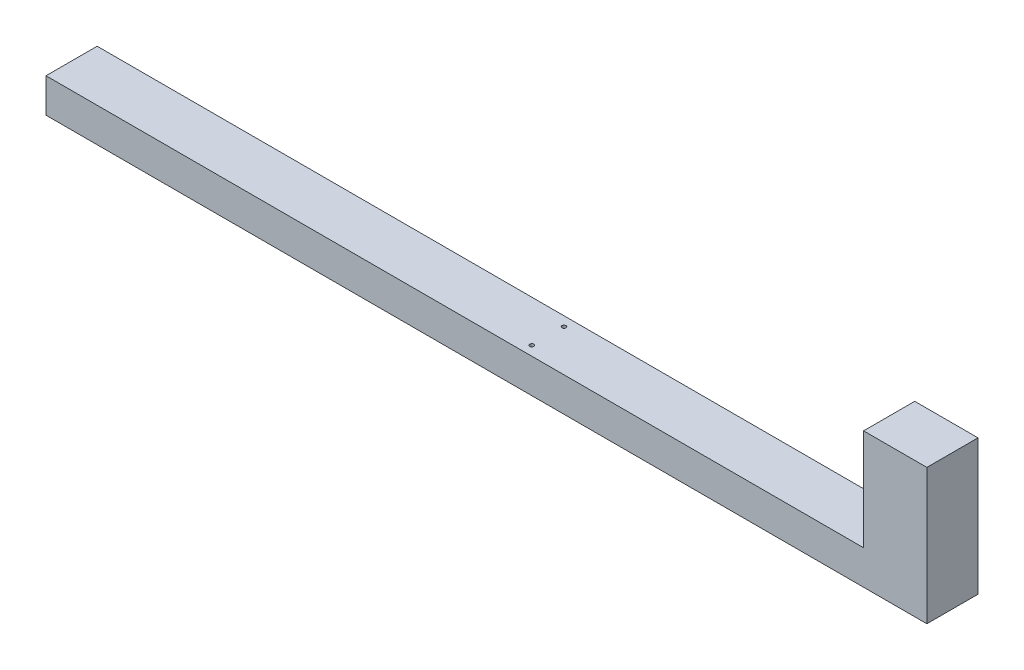
ISO-10303-21;
HEADER;
FILE_DESCRIPTION(('STEP AP214'),'2;1');
FILE_NAME('part.step','',(''),(''),'','','');
FILE_SCHEMA(('AUTOMOTIVE_DESIGN { 1 0 10303 214 1 1 1 1 }'));
ENDSEC;
DATA;
#1=APPLICATION_CONTEXT('core data for automotive mechanical design processes');
#2=APPLICATION_PROTOCOL_DEFINITION('international standard','automotive_design',2000,#1);
#3=PRODUCT_CONTEXT('',#1,'mechanical');
#4=PRODUCT('Part','Part','',(#3));
#5=PRODUCT_RELATED_PRODUCT_CATEGORY('part','',(#4));
#6=PRODUCT_DEFINITION_FORMATION('','',#4);
#7=PRODUCT_DEFINITION_CONTEXT('part definition',#1,'design');
#8=PRODUCT_DEFINITION('design','',#6,#7);
#9=PRODUCT_DEFINITION_SHAPE('','',#8);
#10=(LENGTH_UNIT() NAMED_UNIT(*) SI_UNIT(.MILLI.,.METRE.));
#11=(NAMED_UNIT(*) PLANE_ANGLE_UNIT() SI_UNIT($,.RADIAN.));
#12=(NAMED_UNIT(*) SI_UNIT($,.STERADIAN.) SOLID_ANGLE_UNIT());
#13=UNCERTAINTY_MEASURE_WITH_UNIT(LENGTH_MEASURE(1.E-05),#10,'distance_accuracy_value','');
#14=(GEOMETRIC_REPRESENTATION_CONTEXT(3) GLOBAL_UNCERTAINTY_ASSIGNED_CONTEXT((#13)) GLOBAL_UNIT_ASSIGNED_CONTEXT((#10,
#11,#12)) REPRESENTATION_CONTEXT('',''));
#15=CARTESIAN_POINT('',(0.,0.,0.));
#16=DIRECTION('',(0.,0.,1.));
#17=DIRECTION('',(1.,0.,0.));
#18=AXIS2_PLACEMENT_3D('',#15,#16,#17);
#19=CARTESIAN_POINT('',(-559.5,46.8,35.0000000000001));
#20=DIRECTION('',(1.,0.,0.));
#21=DIRECTION('',(0.,0.,-1.));
#22=AXIS2_PLACEMENT_3D('',#19,#20,#21);
#23=PLANE('',#22);
#24=DIRECTION('',(0.,0.,1.));
#25=VECTOR('',#24,1.);
#26=CARTESIAN_POINT('',(-559.5,0.,35.0000000000001));
#27=LINE('',#26,#25);
#28=CARTESIAN_POINT('',(-559.5,0.,-34.9999999999999));
#29=VERTEX_POINT('',#28);
#30=CARTESIAN_POINT('',(-559.5,0.,35.0000000000001));
#31=VERTEX_POINT('',#30);
#32=EDGE_CURVE('E100',#29,#31,#27,.T.);
#33=ORIENTED_EDGE('',*,*,#32,.T.);
#34=DIRECTION('',(0.,-1.,0.));
#35=VECTOR('',#34,1.);
#36=CARTESIAN_POINT('',(-559.5,46.8,35.0000000000001));
#37=LINE('',#36,#35);
#38=CARTESIAN_POINT('',(-559.5,46.8,35.0000000000001));
#39=VERTEX_POINT('',#38);
#40=EDGE_CURVE('E11',#39,#31,#37,.T.);
#41=ORIENTED_EDGE('',*,*,#40,.F.);
#42=DIRECTION('',(0.,0.,1.));
#43=VECTOR('',#42,1.);
#44=CARTESIAN_POINT('',(-559.5,46.8,35.0000000000001));
#45=LINE('',#44,#43);
#46=CARTESIAN_POINT('',(-559.5,46.8,-34.9999999999999));
#47=VERTEX_POINT('',#46);
#48=EDGE_CURVE('E92',#47,#39,#45,.T.);
#49=ORIENTED_EDGE('',*,*,#48,.F.);
#50=DIRECTION('',(0.,-1.,0.));
#51=VECTOR('',#50,1.);
#52=CARTESIAN_POINT('',(-559.5,46.8,-34.9999999999999));
#53=LINE('',#52,#51);
#54=EDGE_CURVE('E48',#47,#29,#53,.T.);
#55=ORIENTED_EDGE('',*,*,#54,.T.);
#56=EDGE_LOOP('',(#33,#41,#49,#55));
#57=FACE_BOUND('',#56,.T.);
#58=ADVANCED_FACE('F40',(#57),#23,.F.);
#59=CARTESIAN_POINT('',(559.5,46.8,34.9999999999999));
#60=DIRECTION('',(0.,0.,-1.));
#61=DIRECTION('',(-1.,0.,0.));
#62=AXIS2_PLACEMENT_3D('',#59,#60,#61);
#63=PLANE('',#62);
#64=DIRECTION('',(1.,0.,0.));
#65=VECTOR('',#64,1.);
#66=CARTESIAN_POINT('',(559.5,0.,34.9999999999999));
#67=LINE('',#66,#65);
#68=CARTESIAN_POINT('',(646.1,0.,34.9999999999999));
#69=VERTEX_POINT('',#68);
#70=EDGE_CURVE('E69',#31,#69,#67,.T.);
#71=ORIENTED_EDGE('',*,*,#70,.T.);
#72=DIRECTION('',(0.,-1.,0.));
#73=VECTOR('',#72,1.);
#74=CARTESIAN_POINT('',(646.1,185.4,34.9999999999999));
#75=LINE('',#74,#73);
#76=CARTESIAN_POINT('',(646.1,185.4,34.9999999999999));
#77=VERTEX_POINT('',#76);
#78=EDGE_CURVE('E104',#77,#69,#75,.T.);
#79=ORIENTED_EDGE('',*,*,#78,.F.);
#80=DIRECTION('',(-1.,0.,0.));
#81=VECTOR('',#80,1.);
#82=CARTESIAN_POINT('',(559.5,185.4,34.9999999999999));
#83=LINE('',#82,#81);
#84=CARTESIAN_POINT('',(559.5,185.4,34.9999999999999));
#85=VERTEX_POINT('',#84);
#86=EDGE_CURVE('E113',#77,#85,#83,.T.);
#87=ORIENTED_EDGE('',*,*,#86,.T.);
#88=DIRECTION('',(0.,-1.,0.));
#89=VECTOR('',#88,1.);
#90=CARTESIAN_POINT('',(559.5,185.4,34.9999999999999));
#91=LINE('',#90,#89);
#92=CARTESIAN_POINT('',(559.5,46.8,34.9999999999999));
#93=VERTEX_POINT('',#92);
#94=EDGE_CURVE('E91',#85,#93,#91,.T.);
#95=ORIENTED_EDGE('',*,*,#94,.T.);
#96=DIRECTION('',(1.,0.,0.));
#97=VECTOR('',#96,1.);
#98=CARTESIAN_POINT('',(559.5,46.8,34.9999999999999));
#99=LINE('',#98,#97);
#100=EDGE_CURVE('E86',#39,#93,#99,.T.);
#101=ORIENTED_EDGE('',*,*,#100,.F.);
#102=ORIENTED_EDGE('',*,*,#40,.T.);
#103=EDGE_LOOP('',(#71,#79,#87,#95,#101,#102));
#104=FACE_BOUND('',#103,.T.);
#105=ADVANCED_FACE('F87',(#104),#63,.F.);
#106=CARTESIAN_POINT('',(559.5,46.8,-35.0000000000001));
#107=DIRECTION('',(0.,0.,1.));
#108=DIRECTION('',(1.,0.,0.));
#109=AXIS2_PLACEMENT_3D('',#106,#107,#108);
#110=PLANE('',#109);
#111=DIRECTION('',(-1.,0.,0.));
#112=VECTOR('',#111,1.);
#113=CARTESIAN_POINT('',(559.5,0.,-35.0000000000001));
#114=LINE('',#113,#112);
#115=CARTESIAN_POINT('',(646.1,0.,-35.0000000000001));
#116=VERTEX_POINT('',#115);
#117=EDGE_CURVE('E98',#116,#29,#114,.T.);
#118=ORIENTED_EDGE('',*,*,#117,.T.);
#119=ORIENTED_EDGE('',*,*,#54,.F.);
#120=DIRECTION('',(-1.,0.,0.));
#121=VECTOR('',#120,1.);
#122=CARTESIAN_POINT('',(559.5,46.8,-35.0000000000001));
#123=LINE('',#122,#121);
#124=CARTESIAN_POINT('',(559.5,46.8,-35.0000000000001));
#125=VERTEX_POINT('',#124);
#126=EDGE_CURVE('E56',#125,#47,#123,.T.);
#127=ORIENTED_EDGE('',*,*,#126,.F.);
#128=DIRECTION('',(0.,-1.,0.));
#129=VECTOR('',#128,1.);
#130=CARTESIAN_POINT('',(559.5,185.4,-35.0000000000001));
#131=LINE('',#130,#129);
#132=CARTESIAN_POINT('',(559.5,185.4,-35.0000000000001));
#133=VERTEX_POINT('',#132);
#134=EDGE_CURVE('E110',#133,#125,#131,.T.);
#135=ORIENTED_EDGE('',*,*,#134,.F.);
#136=DIRECTION('',(1.,0.,0.));
#137=VECTOR('',#136,1.);
#138=CARTESIAN_POINT('',(559.5,185.4,-35.0000000000001));
#139=LINE('',#138,#137);
#140=CARTESIAN_POINT('',(646.1,185.4,-35.0000000000001));
#141=VERTEX_POINT('',#140);
#142=EDGE_CURVE('E126',#133,#141,#139,.T.);
#143=ORIENTED_EDGE('',*,*,#142,.T.);
#144=DIRECTION('',(0.,-1.,0.));
#145=VECTOR('',#144,1.);
#146=CARTESIAN_POINT('',(646.1,185.4,-35.0000000000001));
#147=LINE('',#146,#145);
#148=EDGE_CURVE('E112',#141,#116,#147,.T.);
#149=ORIENTED_EDGE('',*,*,#148,.T.);
#150=EDGE_LOOP('',(#118,#119,#127,#135,#143,#149));
#151=FACE_BOUND('',#150,.T.);
#152=ADVANCED_FACE('F155',(#151),#110,.F.);
#153=CARTESIAN_POINT('',(0.,46.8,0.));
#154=DIRECTION('',(0.,1.,0.));
#155=DIRECTION('',(0.,0.,1.));
#156=AXIS2_PLACEMENT_3D('',#153,#154,#155);
#157=PLANE('',#156);
#158=CARTESIAN_POINT('',(92.4786413646002,46.8,-22.));
#159=DIRECTION('',(0.,1.,0.));
#160=DIRECTION('',(0.,0.,1.));
#161=AXIS2_PLACEMENT_3D('',#158,#159,#160);
#162=CIRCLE('',#161,2.75000000000001);
#163=CARTESIAN_POINT('',(92.4786413646002,46.8,-19.25));
#164=VERTEX_POINT('',#163);
#165=EDGE_CURVE('E137',#164,#164,#162,.T.);
#166=ORIENTED_EDGE('',*,*,#165,.F.);
#167=EDGE_LOOP('',(#166));
#168=FACE_BOUND('',#167,.T.);
#169=CARTESIAN_POINT('',(92.4786413646002,46.8,22.));
#170=DIRECTION('',(0.,1.,0.));
#171=DIRECTION('',(0.,0.,1.));
#172=AXIS2_PLACEMENT_3D('',#169,#170,#171);
#173=CIRCLE('',#172,2.75000000000001);
#174=CARTESIAN_POINT('',(92.4786413646002,46.8,24.75));
#175=VERTEX_POINT('',#174);
#176=EDGE_CURVE('E134',#175,#175,#173,.T.);
#177=ORIENTED_EDGE('',*,*,#176,.F.);
#178=EDGE_LOOP('',(#177));
#179=FACE_BOUND('',#178,.T.);
#180=ORIENTED_EDGE('',*,*,#48,.T.);
#181=ORIENTED_EDGE('',*,*,#100,.T.);
#182=DIRECTION('',(0.,0.,-1.));
#183=VECTOR('',#182,1.);
#184=CARTESIAN_POINT('',(559.5,46.8,34.9999999999999));
#185=LINE('',#184,#183);
#186=EDGE_CURVE('E76',#93,#125,#185,.T.);
#187=ORIENTED_EDGE('',*,*,#186,.T.);
#188=ORIENTED_EDGE('',*,*,#126,.T.);
#189=EDGE_LOOP('',(#180,#181,#187,#188));
#190=FACE_BOUND('',#189,.T.);
#191=ADVANCED_FACE('F95',(#168,#179,#190),#157,.T.);
#192=CARTESIAN_POINT('',(0.,0.,0.));
#193=DIRECTION('',(0.,1.,0.));
#194=DIRECTION('',(0.,0.,1.));
#195=AXIS2_PLACEMENT_3D('',#192,#193,#194);
#196=PLANE('',#195);
#197=ORIENTED_EDGE('',*,*,#32,.F.);
#198=ORIENTED_EDGE('',*,*,#117,.F.);
#199=DIRECTION('',(0.,0.,1.));
#200=VECTOR('',#199,1.);
#201=CARTESIAN_POINT('',(646.1,0.,34.9999999999999));
#202=LINE('',#201,#200);
#203=EDGE_CURVE('E118',#116,#69,#202,.T.);
#204=ORIENTED_EDGE('',*,*,#203,.T.);
#205=ORIENTED_EDGE('',*,*,#70,.F.);
#206=EDGE_LOOP('',(#197,#198,#204,#205));
#207=FACE_BOUND('',#206,.T.);
#208=ADVANCED_FACE('F154',(#207),#196,.F.);
#209=CARTESIAN_POINT('',(559.5,185.4,34.9999999999999));
#210=DIRECTION('',(-1.,0.,0.));
#211=DIRECTION('',(0.,0.,1.));
#212=AXIS2_PLACEMENT_3D('',#209,#210,#211);
#213=PLANE('',#212);
#214=ORIENTED_EDGE('',*,*,#186,.F.);
#215=ORIENTED_EDGE('',*,*,#94,.F.);
#216=DIRECTION('',(0.,0.,-1.));
#217=VECTOR('',#216,1.);
#218=CARTESIAN_POINT('',(559.5,185.4,34.9999999999999));
#219=LINE('',#218,#217);
#220=EDGE_CURVE('E120',#85,#133,#219,.T.);
#221=ORIENTED_EDGE('',*,*,#220,.T.);
#222=ORIENTED_EDGE('',*,*,#134,.T.);
#223=EDGE_LOOP('',(#214,#215,#221,#222));
#224=FACE_BOUND('',#223,.T.);
#225=ADVANCED_FACE('F185',(#224),#213,.T.);
#226=CARTESIAN_POINT('',(646.1,185.4,34.9999999999999));
#227=DIRECTION('',(1.,0.,0.));
#228=DIRECTION('',(0.,0.,-1.));
#229=AXIS2_PLACEMENT_3D('',#226,#227,#228);
#230=PLANE('',#229);
#231=ORIENTED_EDGE('',*,*,#203,.F.);
#232=ORIENTED_EDGE('',*,*,#148,.F.);
#233=DIRECTION('',(0.,0.,1.));
#234=VECTOR('',#233,1.);
#235=CARTESIAN_POINT('',(646.1,185.4,34.9999999999999));
#236=LINE('',#235,#234);
#237=EDGE_CURVE('E123',#141,#77,#236,.T.);
#238=ORIENTED_EDGE('',*,*,#237,.T.);
#239=ORIENTED_EDGE('',*,*,#78,.T.);
#240=EDGE_LOOP('',(#231,#232,#238,#239));
#241=FACE_BOUND('',#240,.T.);
#242=ADVANCED_FACE('F170',(#241),#230,.T.);
#243=CARTESIAN_POINT('',(0.,185.4,0.));
#244=DIRECTION('',(0.,-1.,0.));
#245=DIRECTION('',(0.,0.,-1.));
#246=AXIS2_PLACEMENT_3D('',#243,#244,#245);
#247=PLANE('',#246);
#248=ORIENTED_EDGE('',*,*,#220,.F.);
#249=ORIENTED_EDGE('',*,*,#86,.F.);
#250=ORIENTED_EDGE('',*,*,#237,.F.);
#251=ORIENTED_EDGE('',*,*,#142,.F.);
#252=EDGE_LOOP('',(#248,#249,#250,#251));
#253=FACE_BOUND('',#252,.T.);
#254=ADVANCED_FACE('F161',(#253),#247,.F.);
#255=CARTESIAN_POINT('',(92.4786413646002,36.8,22.));
#256=DIRECTION('',(0.,1.,0.));
#257=DIRECTION('',(0.,0.,1.));
#258=AXIS2_PLACEMENT_3D('',#255,#256,#257);
#259=CYLINDRICAL_SURFACE('',#258,2.75000000000001);
#260=CARTESIAN_POINT('',(92.4786413646002,36.8,22.));
#261=DIRECTION('',(0.,1.,0.));
#262=DIRECTION('',(0.,0.,1.));
#263=AXIS2_PLACEMENT_3D('',#260,#261,#262);
#264=CIRCLE('',#263,2.75000000000001);
#265=CARTESIAN_POINT('',(92.4786413646002,36.8,24.75));
#266=VERTEX_POINT('',#265);
#267=EDGE_CURVE('E131',#266,#266,#264,.T.);
#268=ORIENTED_EDGE('',*,*,#267,.F.);
#269=EDGE_LOOP('',(#268));
#270=FACE_BOUND('',#269,.T.);
#271=ORIENTED_EDGE('',*,*,#176,.T.);
#272=EDGE_LOOP('',(#271));
#273=FACE_BOUND('',#272,.T.);
#274=ADVANCED_FACE('F159',(#270,#273),#259,.F.);
#275=CARTESIAN_POINT('',(92.4786413646002,36.8,22.));
#276=DIRECTION('',(0.,1.,0.));
#277=DIRECTION('',(0.,0.,1.));
#278=AXIS2_PLACEMENT_3D('',#275,#276,#277);
#279=PLANE('',#278);
#280=ORIENTED_EDGE('',*,*,#267,.T.);
#281=EDGE_LOOP('',(#280));
#282=FACE_BOUND('',#281,.T.);
#283=ADVANCED_FACE('F148',(#282),#279,.T.);
#284=CARTESIAN_POINT('',(92.4786413646002,36.8,-22.));
#285=DIRECTION('',(0.,1.,0.));
#286=DIRECTION('',(0.,0.,1.));
#287=AXIS2_PLACEMENT_3D('',#284,#285,#286);
#288=CYLINDRICAL_SURFACE('',#287,2.75000000000001);
#289=CARTESIAN_POINT('',(92.4786413646002,36.8,-22.));
#290=DIRECTION('',(0.,1.,0.));
#291=DIRECTION('',(0.,0.,1.));
#292=AXIS2_PLACEMENT_3D('',#289,#290,#291);
#293=CIRCLE('',#292,2.75000000000001);
#294=CARTESIAN_POINT('',(92.4786413646002,36.8,-19.25));
#295=VERTEX_POINT('',#294);
#296=EDGE_CURVE('E121',#295,#295,#293,.T.);
#297=ORIENTED_EDGE('',*,*,#296,.F.);
#298=EDGE_LOOP('',(#297));
#299=FACE_BOUND('',#298,.T.);
#300=ORIENTED_EDGE('',*,*,#165,.T.);
#301=EDGE_LOOP('',(#300));
#302=FACE_BOUND('',#301,.T.);
#303=ADVANCED_FACE('F145',(#299,#302),#288,.F.);
#304=CARTESIAN_POINT('',(92.4786413646002,36.8,-22.));
#305=DIRECTION('',(0.,1.,0.));
#306=DIRECTION('',(0.,0.,1.));
#307=AXIS2_PLACEMENT_3D('',#304,#305,#306);
#308=PLANE('',#307);
#309=ORIENTED_EDGE('',*,*,#296,.T.);
#310=EDGE_LOOP('',(#309));
#311=FACE_BOUND('',#310,.T.);
#312=ADVANCED_FACE('F143',(#311),#308,.T.);
#313=CLOSED_SHELL('',(#58,#105,#152,#191,#208,#225,#242,#254,#274,#283,#303,#312));
#314=MANIFOLD_SOLID_BREP('B2',#313);
#315=ADVANCED_BREP_SHAPE_REPRESENTATION('',(#18,#314),#14);
#316=SHAPE_DEFINITION_REPRESENTATION(#9,#315);
ENDSEC;
END-ISO-10303-21;
